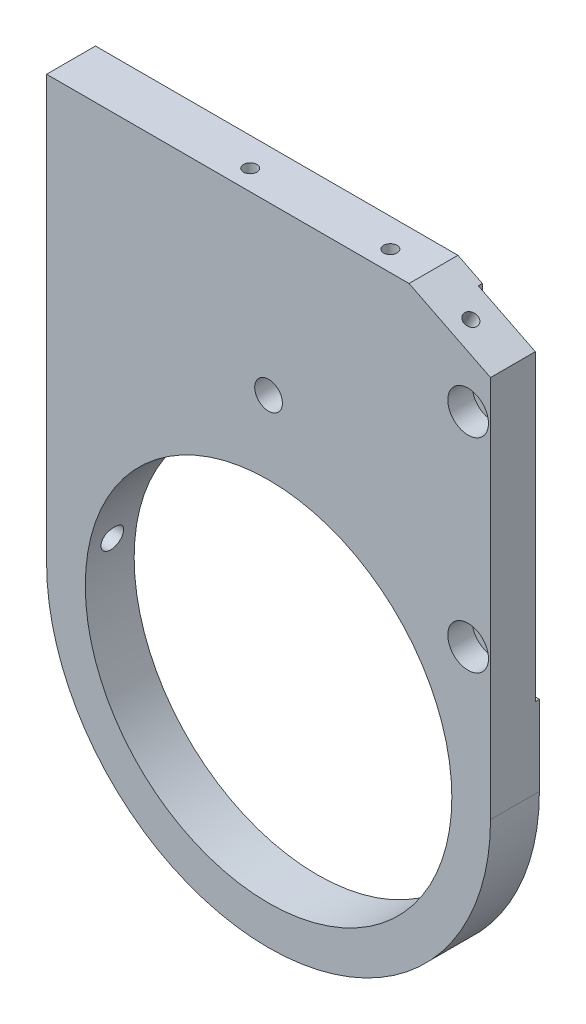
ISO-10303-21;
HEADER;
FILE_DESCRIPTION(('STEP AP214'),'2;1');
FILE_NAME('part.step','',(''),(''),'','','');
FILE_SCHEMA(('AUTOMOTIVE_DESIGN { 1 0 10303 214 1 1 1 1 }'));
ENDSEC;
DATA;
#1=APPLICATION_CONTEXT('core data for automotive mechanical design processes');
#2=APPLICATION_PROTOCOL_DEFINITION('international standard','automotive_design',2000,#1);
#3=PRODUCT_CONTEXT('',#1,'mechanical');
#4=PRODUCT('Part','Part','',(#3));
#5=PRODUCT_RELATED_PRODUCT_CATEGORY('part','',(#4));
#6=PRODUCT_DEFINITION_FORMATION('','',#4);
#7=PRODUCT_DEFINITION_CONTEXT('part definition',#1,'design');
#8=PRODUCT_DEFINITION('design','',#6,#7);
#9=PRODUCT_DEFINITION_SHAPE('','',#8);
#10=(LENGTH_UNIT() NAMED_UNIT(*) SI_UNIT(.MILLI.,.METRE.));
#11=(NAMED_UNIT(*) PLANE_ANGLE_UNIT() SI_UNIT($,.RADIAN.));
#12=(NAMED_UNIT(*) SI_UNIT($,.STERADIAN.) SOLID_ANGLE_UNIT());
#13=UNCERTAINTY_MEASURE_WITH_UNIT(LENGTH_MEASURE(1.E-05),#10,'distance_accuracy_value','');
#14=(GEOMETRIC_REPRESENTATION_CONTEXT(3) GLOBAL_UNCERTAINTY_ASSIGNED_CONTEXT((#13)) GLOBAL_UNIT_ASSIGNED_CONTEXT((#10,
#11,#12)) REPRESENTATION_CONTEXT('',''));
#15=CARTESIAN_POINT('',(0.,0.,0.));
#16=DIRECTION('',(0.,0.,1.));
#17=DIRECTION('',(1.,0.,0.));
#18=AXIS2_PLACEMENT_3D('',#15,#16,#17);
#19=CARTESIAN_POINT('',(49.,34.,20.7));
#20=DIRECTION('',(0.,0.,-1.));
#21=DIRECTION('',(1.,0.,0.));
#22=AXIS2_PLACEMENT_3D('',#19,#20,#21);
#23=CYLINDRICAL_SURFACE('',#22,3.25);
#24=CARTESIAN_POINT('',(49.,34.,-17.));
#25=DIRECTION('',(0.,0.,1.));
#26=DIRECTION('',(1.,0.,0.));
#27=AXIS2_PLACEMENT_3D('',#24,#25,#26);
#28=CIRCLE('',#27,3.25);
#29=CARTESIAN_POINT('',(52.25,34.,-17.));
#30=VERTEX_POINT('',#29);
#31=EDGE_CURVE('E181',#30,#30,#28,.T.);
#32=ORIENTED_EDGE('',*,*,#31,.F.);
#33=EDGE_LOOP('',(#32));
#34=FACE_BOUND('',#33,.T.);
#35=CARTESIAN_POINT('',(49.,34.,-12.));
#36=DIRECTION('',(0.,0.,-1.));
#37=DIRECTION('',(-1.,0.,0.));
#38=AXIS2_PLACEMENT_3D('',#35,#36,#37);
#39=CIRCLE('',#38,3.25);
#40=CARTESIAN_POINT('',(45.75,34.,-12.));
#41=VERTEX_POINT('',#40);
#42=EDGE_CURVE('E171',#41,#41,#39,.F.);
#43=ORIENTED_EDGE('',*,*,#42,.T.);
#44=EDGE_LOOP('',(#43));
#45=FACE_BOUND('',#44,.T.);
#46=ADVANCED_FACE('F36',(#34,#45),#23,.F.);
#47=CARTESIAN_POINT('',(49.,84.,20.7));
#48=DIRECTION('',(0.,0.,-1.));
#49=DIRECTION('',(1.,0.,0.));
#50=AXIS2_PLACEMENT_3D('',#47,#48,#49);
#51=CYLINDRICAL_SURFACE('',#50,3.25);
#52=CARTESIAN_POINT('',(49.,84.,-17.));
#53=DIRECTION('',(0.,0.,1.));
#54=DIRECTION('',(1.,0.,0.));
#55=AXIS2_PLACEMENT_3D('',#52,#53,#54);
#56=CIRCLE('',#55,3.25);
#57=CARTESIAN_POINT('',(52.25,84.,-17.));
#58=VERTEX_POINT('',#57);
#59=EDGE_CURVE('E184',#58,#58,#56,.T.);
#60=ORIENTED_EDGE('',*,*,#59,.F.);
#61=EDGE_LOOP('',(#60));
#62=FACE_BOUND('',#61,.T.);
#63=CARTESIAN_POINT('',(49.,84.,-12.));
#64=DIRECTION('',(0.,0.,-1.));
#65=DIRECTION('',(-1.,0.,0.));
#66=AXIS2_PLACEMENT_3D('',#63,#64,#65);
#67=CIRCLE('',#66,3.25);
#68=CARTESIAN_POINT('',(45.75,84.,-12.));
#69=VERTEX_POINT('',#68);
#70=EDGE_CURVE('E177',#69,#69,#67,.F.);
#71=ORIENTED_EDGE('',*,*,#70,.T.);
#72=EDGE_LOOP('',(#71));
#73=FACE_BOUND('',#72,.T.);
#74=ADVANCED_FACE('F301',(#62,#73),#51,.F.);
#75=CARTESIAN_POINT('',(0.,0.,-18.));
#76=DIRECTION('',(0.,0.,-1.));
#77=DIRECTION('',(1.,0.,0.));
#78=AXIS2_PLACEMENT_3D('',#75,#76,#77);
#79=PLANE('',#78);
#80=CARTESIAN_POINT('',(0.,63.,-18.));
#81=DIRECTION('',(0.,0.,1.));
#82=DIRECTION('',(1.,0.,0.));
#83=AXIS2_PLACEMENT_3D('',#80,#81,#82);
#84=CIRCLE('',#83,3.39999999999999);
#85=CARTESIAN_POINT('',(3.39999999999999,63.,-18.));
#86=VERTEX_POINT('',#85);
#87=EDGE_CURVE('E152',#86,#86,#84,.T.);
#88=ORIENTED_EDGE('',*,*,#87,.T.);
#89=EDGE_LOOP('',(#88));
#90=FACE_BOUND('',#89,.T.);
#91=DIRECTION('',(0.,-1.,0.));
#92=VECTOR('',#91,1.);
#93=CARTESIAN_POINT('',(40.5,104.,-18.));
#94=LINE('',#93,#92);
#95=CARTESIAN_POINT('',(40.5,101.,-18.));
#96=VERTEX_POINT('',#95);
#97=CARTESIAN_POINT('',(40.5,24.6,-18.));
#98=VERTEX_POINT('',#97);
#99=EDGE_CURVE('E187',#96,#98,#94,.T.);
#100=ORIENTED_EDGE('',*,*,#99,.T.);
#101=CARTESIAN_POINT('',(45.5,24.6,-18.));
#102=DIRECTION('',(0.,0.,1.));
#103=DIRECTION('',(1.,0.,0.));
#104=AXIS2_PLACEMENT_3D('',#101,#102,#103);
#105=CIRCLE('',#104,5.);
#106=CARTESIAN_POINT('',(45.5,19.6,-18.));
#107=VERTEX_POINT('',#106);
#108=EDGE_CURVE('E199',#98,#107,#105,.T.);
#109=ORIENTED_EDGE('',*,*,#108,.T.);
#110=DIRECTION('',(1.,0.,0.));
#111=VECTOR('',#110,1.);
#112=CARTESIAN_POINT('',(45.5,19.6,-18.));
#113=LINE('',#112,#111);
#114=CARTESIAN_POINT('',(54.5,19.6,-18.));
#115=VERTEX_POINT('',#114);
#116=EDGE_CURVE('E192',#107,#115,#113,.T.);
#117=ORIENTED_EDGE('',*,*,#116,.T.);
#118=DIRECTION('',(0.,1.,0.));
#119=VECTOR('',#118,1.);
#120=CARTESIAN_POINT('',(54.5,94.,-18.));
#121=LINE('',#120,#119);
#122=CARTESIAN_POINT('',(54.5,0.,-18.));
#123=VERTEX_POINT('',#122);
#124=EDGE_CURVE('E238',#123,#115,#121,.T.);
#125=ORIENTED_EDGE('',*,*,#124,.F.);
#126=CARTESIAN_POINT('',(0.,0.,-18.));
#127=DIRECTION('',(0.,0.,1.));
#128=DIRECTION('',(1.,0.,0.));
#129=AXIS2_PLACEMENT_3D('',#126,#127,#128);
#130=CIRCLE('',#129,54.5);
#131=CARTESIAN_POINT('',(-54.5,0.,-18.));
#132=VERTEX_POINT('',#131);
#133=EDGE_CURVE('E235',#132,#123,#130,.T.);
#134=ORIENTED_EDGE('',*,*,#133,.F.);
#135=DIRECTION('',(0.,-1.,0.));
#136=VECTOR('',#135,1.);
#137=CARTESIAN_POINT('',(-54.5,0.,-18.));
#138=LINE('',#137,#136);
#139=CARTESIAN_POINT('',(-54.5,104.,-18.));
#140=VERTEX_POINT('',#139);
#141=EDGE_CURVE('E248',#140,#132,#138,.T.);
#142=ORIENTED_EDGE('',*,*,#141,.F.);
#143=DIRECTION('',(-1.,0.,0.));
#144=VECTOR('',#143,1.);
#145=CARTESIAN_POINT('',(-54.5,104.,-18.));
#146=LINE('',#145,#144);
#147=CARTESIAN_POINT('',(34.5,104.,-18.));
#148=VERTEX_POINT('',#147);
#149=EDGE_CURVE('E245',#148,#140,#146,.T.);
#150=ORIENTED_EDGE('',*,*,#149,.F.);
#151=DIRECTION('',(-0.894427190999916,0.447213595499958,0.));
#152=VECTOR('',#151,1.);
#153=CARTESIAN_POINT('',(34.5,104.,-18.));
#154=LINE('',#153,#152);
#155=EDGE_CURVE('E242',#96,#148,#154,.T.);
#156=ORIENTED_EDGE('',*,*,#155,.F.);
#157=EDGE_LOOP('',(#100,#109,#117,#125,#134,#142,#150,#156));
#158=FACE_BOUND('',#157,.T.);
#159=CARTESIAN_POINT('',(0.,0.,-18.));
#160=DIRECTION('',(0.,0.,1.));
#161=DIRECTION('',(1.,0.,0.));
#162=AXIS2_PLACEMENT_3D('',#159,#160,#161);
#163=CIRCLE('',#162,45.);
#164=CARTESIAN_POINT('',(45.,0.,-18.));
#165=VERTEX_POINT('',#164);
#166=EDGE_CURVE('E229',#165,#165,#163,.T.);
#167=ORIENTED_EDGE('',*,*,#166,.T.);
#168=EDGE_LOOP('',(#167));
#169=FACE_BOUND('',#168,.T.);
#170=ADVANCED_FACE('F296',(#90,#158,#169),#79,.T.);
#171=CARTESIAN_POINT('',(0.,0.,-6.));
#172=DIRECTION('',(0.,0.,-1.));
#173=DIRECTION('',(1.,0.,0.));
#174=AXIS2_PLACEMENT_3D('',#171,#172,#173);
#175=PLANE('',#174);
#176=CARTESIAN_POINT('',(0.,63.,-6.));
#177=DIRECTION('',(0.,0.,1.));
#178=DIRECTION('',(1.,0.,0.));
#179=AXIS2_PLACEMENT_3D('',#176,#177,#178);
#180=CIRCLE('',#179,3.4);
#181=CARTESIAN_POINT('',(3.4,63.,-6.));
#182=VERTEX_POINT('',#181);
#183=EDGE_CURVE('E149',#182,#182,#180,.T.);
#184=ORIENTED_EDGE('',*,*,#183,.F.);
#185=EDGE_LOOP('',(#184));
#186=FACE_BOUND('',#185,.T.);
#187=CARTESIAN_POINT('',(49.,34.,-6.));
#188=DIRECTION('',(0.,0.,-1.));
#189=DIRECTION('',(-1.,0.,0.));
#190=AXIS2_PLACEMENT_3D('',#187,#188,#189);
#191=CIRCLE('',#190,5.);
#192=CARTESIAN_POINT('',(44.,34.,-6.));
#193=VERTEX_POINT('',#192);
#194=EDGE_CURVE('E167',#193,#193,#191,.T.);
#195=ORIENTED_EDGE('',*,*,#194,.T.);
#196=EDGE_LOOP('',(#195));
#197=FACE_BOUND('',#196,.T.);
#198=CARTESIAN_POINT('',(49.,84.,-6.));
#199=DIRECTION('',(0.,0.,-1.));
#200=DIRECTION('',(-1.,0.,0.));
#201=AXIS2_PLACEMENT_3D('',#198,#199,#200);
#202=CIRCLE('',#201,5.);
#203=CARTESIAN_POINT('',(44.,84.,-6.));
#204=VERTEX_POINT('',#203);
#205=EDGE_CURVE('E178',#204,#204,#202,.T.);
#206=ORIENTED_EDGE('',*,*,#205,.T.);
#207=EDGE_LOOP('',(#206));
#208=FACE_BOUND('',#207,.T.);
#209=CARTESIAN_POINT('',(0.,0.,-6.));
#210=DIRECTION('',(0.,0.,1.));
#211=DIRECTION('',(1.,0.,0.));
#212=AXIS2_PLACEMENT_3D('',#209,#210,#211);
#213=CIRCLE('',#212,54.5);
#214=CARTESIAN_POINT('',(-54.5,0.,-6.));
#215=VERTEX_POINT('',#214);
#216=CARTESIAN_POINT('',(54.5,0.,-6.));
#217=VERTEX_POINT('',#216);
#218=EDGE_CURVE('E232',#215,#217,#213,.T.);
#219=ORIENTED_EDGE('',*,*,#218,.T.);
#220=DIRECTION('',(0.,1.,0.));
#221=VECTOR('',#220,1.);
#222=CARTESIAN_POINT('',(54.5,94.,-6.));
#223=LINE('',#222,#221);
#224=CARTESIAN_POINT('',(54.5,94.,-6.));
#225=VERTEX_POINT('',#224);
#226=EDGE_CURVE('E254',#217,#225,#223,.T.);
#227=ORIENTED_EDGE('',*,*,#226,.T.);
#228=DIRECTION('',(-0.894427190999916,0.447213595499958,0.));
#229=VECTOR('',#228,1.);
#230=CARTESIAN_POINT('',(34.5,104.,-6.));
#231=LINE('',#230,#229);
#232=CARTESIAN_POINT('',(34.5,104.,-6.));
#233=VERTEX_POINT('',#232);
#234=EDGE_CURVE('E257',#225,#233,#231,.T.);
#235=ORIENTED_EDGE('',*,*,#234,.T.);
#236=DIRECTION('',(-1.,0.,0.));
#237=VECTOR('',#236,1.);
#238=CARTESIAN_POINT('',(-54.5,104.,-6.));
#239=LINE('',#238,#237);
#240=CARTESIAN_POINT('',(-54.5,104.,-6.));
#241=VERTEX_POINT('',#240);
#242=EDGE_CURVE('E260',#233,#241,#239,.T.);
#243=ORIENTED_EDGE('',*,*,#242,.T.);
#244=DIRECTION('',(0.,-1.,0.));
#245=VECTOR('',#244,1.);
#246=CARTESIAN_POINT('',(-54.5,0.,-6.));
#247=LINE('',#246,#245);
#248=EDGE_CURVE('E239',#241,#215,#247,.T.);
#249=ORIENTED_EDGE('',*,*,#248,.T.);
#250=EDGE_LOOP('',(#219,#227,#235,#243,#249));
#251=FACE_BOUND('',#250,.T.);
#252=CARTESIAN_POINT('',(0.,0.,-6.));
#253=DIRECTION('',(0.,0.,1.));
#254=DIRECTION('',(1.,0.,0.));
#255=AXIS2_PLACEMENT_3D('',#252,#253,#254);
#256=CIRCLE('',#255,45.);
#257=CARTESIAN_POINT('',(45.,0.,-6.));
#258=VERTEX_POINT('',#257);
#259=EDGE_CURVE('E228',#258,#258,#256,.T.);
#260=ORIENTED_EDGE('',*,*,#259,.F.);
#261=EDGE_LOOP('',(#260));
#262=FACE_BOUND('',#261,.T.);
#263=ADVANCED_FACE('F300',(#186,#197,#208,#251,#262),#175,.F.);
#264=CARTESIAN_POINT('',(0.,0.,-18.));
#265=DIRECTION('',(0.,0.,1.));
#266=DIRECTION('',(-1.,0.,0.));
#267=AXIS2_PLACEMENT_3D('',#264,#265,#266);
#268=CYLINDRICAL_SURFACE('',#267,54.5);
#269=ORIENTED_EDGE('',*,*,#218,.F.);
#270=DIRECTION('',(0.,0.,1.));
#271=VECTOR('',#270,1.);
#272=CARTESIAN_POINT('',(-54.5,0.,-18.));
#273=LINE('',#272,#271);
#274=EDGE_CURVE('E251',#132,#215,#273,.T.);
#275=ORIENTED_EDGE('',*,*,#274,.F.);
#276=ORIENTED_EDGE('',*,*,#133,.T.);
#277=DIRECTION('',(0.,0.,1.));
#278=VECTOR('',#277,1.);
#279=CARTESIAN_POINT('',(54.5,0.,-18.));
#280=LINE('',#279,#278);
#281=EDGE_CURVE('E272',#123,#217,#280,.T.);
#282=ORIENTED_EDGE('',*,*,#281,.T.);
#283=EDGE_LOOP('',(#269,#275,#276,#282));
#284=FACE_BOUND('',#283,.T.);
#285=ADVANCED_FACE('F38',(#284),#268,.T.);
#286=CARTESIAN_POINT('',(54.5,94.,-18.));
#287=DIRECTION('',(-1.,0.,0.));
#288=DIRECTION('',(0.,-1.,0.));
#289=AXIS2_PLACEMENT_3D('',#286,#287,#288);
#290=PLANE('',#289);
#291=DIRECTION('',(0.,1.,0.));
#292=VECTOR('',#291,1.);
#293=CARTESIAN_POINT('',(54.5,94.,-17.));
#294=LINE('',#293,#292);
#295=CARTESIAN_POINT('',(54.5,19.6,-17.));
#296=VERTEX_POINT('',#295);
#297=CARTESIAN_POINT('',(54.5,94.,-17.));
#298=VERTEX_POINT('',#297);
#299=EDGE_CURVE('E206',#296,#298,#294,.T.);
#300=ORIENTED_EDGE('',*,*,#299,.T.);
#301=DIRECTION('',(0.,0.,1.));
#302=VECTOR('',#301,1.);
#303=CARTESIAN_POINT('',(54.5,94.,-18.));
#304=LINE('',#303,#302);
#305=EDGE_CURVE('E270',#298,#225,#304,.T.);
#306=ORIENTED_EDGE('',*,*,#305,.T.);
#307=ORIENTED_EDGE('',*,*,#226,.F.);
#308=ORIENTED_EDGE('',*,*,#281,.F.);
#309=ORIENTED_EDGE('',*,*,#124,.T.);
#310=DIRECTION('',(0.,0.,-1.));
#311=VECTOR('',#310,1.);
#312=CARTESIAN_POINT('',(54.5,19.6,-18.));
#313=LINE('',#312,#311);
#314=EDGE_CURVE('E141',#296,#115,#313,.T.);
#315=ORIENTED_EDGE('',*,*,#314,.F.);
#316=EDGE_LOOP('',(#300,#306,#307,#308,#309,#315));
#317=FACE_BOUND('',#316,.T.);
#318=ADVANCED_FACE('F314',(#317),#290,.F.);
#319=CARTESIAN_POINT('',(34.5,104.,-18.));
#320=DIRECTION('',(-0.447213595499958,-0.894427190999916,0.));
#321=DIRECTION('',(0.894427190999916,-0.447213595499958,0.));
#322=AXIS2_PLACEMENT_3D('',#319,#320,#321);
#323=PLANE('',#322);
#324=CARTESIAN_POINT('',(44.6613008990009,98.9193495504995,-11.));
#325=DIRECTION('',(-0.447213595499958,-0.894427190999916,0.));
#326=DIRECTION('',(-0.894427190999916,0.447213595499958,0.));
#327=AXIS2_PLACEMENT_3D('',#324,#325,#326);
#328=CIRCLE('',#327,1.64999999999999);
#329=CARTESIAN_POINT('',(43.1854960338511,99.6572519830745,-11.));
#330=VERTEX_POINT('',#329);
#331=EDGE_CURVE('E222',#330,#330,#328,.T.);
#332=ORIENTED_EDGE('',*,*,#331,.T.);
#333=EDGE_LOOP('',(#332));
#334=FACE_BOUND('',#333,.T.);
#335=ORIENTED_EDGE('',*,*,#155,.T.);
#336=DIRECTION('',(0.,0.,1.));
#337=VECTOR('',#336,1.);
#338=CARTESIAN_POINT('',(34.5,104.,-18.));
#339=LINE('',#338,#337);
#340=EDGE_CURVE('E268',#148,#233,#339,.T.);
#341=ORIENTED_EDGE('',*,*,#340,.T.);
#342=ORIENTED_EDGE('',*,*,#234,.F.);
#343=ORIENTED_EDGE('',*,*,#305,.F.);
#344=DIRECTION('',(-0.894427190999916,0.447213595499958,0.));
#345=VECTOR('',#344,1.);
#346=CARTESIAN_POINT('',(34.5,104.,-17.));
#347=LINE('',#346,#345);
#348=CARTESIAN_POINT('',(40.5,101.,-17.));
#349=VERTEX_POINT('',#348);
#350=EDGE_CURVE('E64',#298,#349,#347,.T.);
#351=ORIENTED_EDGE('',*,*,#350,.T.);
#352=DIRECTION('',(0.,0.,1.));
#353=VECTOR('',#352,1.);
#354=CARTESIAN_POINT('',(40.5,101.,-18.));
#355=LINE('',#354,#353);
#356=EDGE_CURVE('E275',#96,#349,#355,.T.);
#357=ORIENTED_EDGE('',*,*,#356,.F.);
#358=EDGE_LOOP('',(#335,#341,#342,#343,#351,#357));
#359=FACE_BOUND('',#358,.T.);
#360=ADVANCED_FACE('F311',(#334,#359),#323,.F.);
#361=CARTESIAN_POINT('',(-54.5,104.,-18.));
#362=DIRECTION('',(0.,-1.,0.));
#363=DIRECTION('',(0.,0.,1.));
#364=AXIS2_PLACEMENT_3D('',#361,#362,#363);
#365=PLANE('',#364);
#366=CARTESIAN_POINT('',(-9.5,104.,-11.));
#367=DIRECTION('',(0.,-1.,0.));
#368=DIRECTION('',(0.,0.,-1.));
#369=AXIS2_PLACEMENT_3D('',#366,#367,#368);
#370=CIRCLE('',#369,1.64999999999999);
#371=CARTESIAN_POINT('',(-9.5,104.,-12.65));
#372=VERTEX_POINT('',#371);
#373=EDGE_CURVE('E210',#372,#372,#370,.T.);
#374=ORIENTED_EDGE('',*,*,#373,.T.);
#375=EDGE_LOOP('',(#374));
#376=FACE_BOUND('',#375,.T.);
#377=CARTESIAN_POINT('',(24.9,104.,-11.));
#378=DIRECTION('',(0.,-1.,0.));
#379=DIRECTION('',(0.,0.,-1.));
#380=AXIS2_PLACEMENT_3D('',#377,#378,#379);
#381=CIRCLE('',#380,1.64999999999999);
#382=CARTESIAN_POINT('',(24.9,104.,-12.65));
#383=VERTEX_POINT('',#382);
#384=EDGE_CURVE('E216',#383,#383,#381,.T.);
#385=ORIENTED_EDGE('',*,*,#384,.T.);
#386=EDGE_LOOP('',(#385));
#387=FACE_BOUND('',#386,.T.);
#388=ORIENTED_EDGE('',*,*,#242,.F.);
#389=ORIENTED_EDGE('',*,*,#340,.F.);
#390=ORIENTED_EDGE('',*,*,#149,.T.);
#391=DIRECTION('',(0.,0.,1.));
#392=VECTOR('',#391,1.);
#393=CARTESIAN_POINT('',(-54.5,104.,-18.));
#394=LINE('',#393,#392);
#395=EDGE_CURVE('E266',#140,#241,#394,.T.);
#396=ORIENTED_EDGE('',*,*,#395,.T.);
#397=EDGE_LOOP('',(#388,#389,#390,#396));
#398=FACE_BOUND('',#397,.T.);
#399=ADVANCED_FACE('F308',(#376,#387,#398),#365,.F.);
#400=CARTESIAN_POINT('',(-54.5,0.,-18.));
#401=DIRECTION('',(1.,0.,0.));
#402=DIRECTION('',(0.,0.,1.));
#403=AXIS2_PLACEMENT_3D('',#400,#401,#402);
#404=PLANE('',#403);
#405=CARTESIAN_POINT('',(-54.5,7.49999999999999,-12.));
#406=DIRECTION('',(1.,0.,0.));
#407=DIRECTION('',(0.,0.,-1.));
#408=AXIS2_PLACEMENT_3D('',#405,#406,#407);
#409=CIRCLE('',#408,2.74999999999999);
#410=CARTESIAN_POINT('',(-54.5,7.49999999999999,-14.75));
#411=VERTEX_POINT('',#410);
#412=EDGE_CURVE('E136',#411,#411,#409,.T.);
#413=ORIENTED_EDGE('',*,*,#412,.T.);
#414=EDGE_LOOP('',(#413));
#415=FACE_BOUND('',#414,.T.);
#416=CARTESIAN_POINT('',(-54.5,96.5,-12.));
#417=DIRECTION('',(1.,0.,0.));
#418=DIRECTION('',(0.,0.,-1.));
#419=AXIS2_PLACEMENT_3D('',#416,#417,#418);
#420=CIRCLE('',#419,2.75);
#421=CARTESIAN_POINT('',(-54.5,96.5,-14.75));
#422=VERTEX_POINT('',#421);
#423=EDGE_CURVE('E135',#422,#422,#420,.T.);
#424=ORIENTED_EDGE('',*,*,#423,.T.);
#425=EDGE_LOOP('',(#424));
#426=FACE_BOUND('',#425,.T.);
#427=CARTESIAN_POINT('',(-54.5,51.7,-12.));
#428=DIRECTION('',(1.,0.,0.));
#429=DIRECTION('',(0.,0.,-1.));
#430=AXIS2_PLACEMENT_3D('',#427,#428,#429);
#431=CIRCLE('',#430,2.75);
#432=CARTESIAN_POINT('',(-54.5,51.7,-14.75));
#433=VERTEX_POINT('',#432);
#434=EDGE_CURVE('E161',#433,#433,#431,.T.);
#435=ORIENTED_EDGE('',*,*,#434,.T.);
#436=EDGE_LOOP('',(#435));
#437=FACE_BOUND('',#436,.T.);
#438=ORIENTED_EDGE('',*,*,#248,.F.);
#439=ORIENTED_EDGE('',*,*,#395,.F.);
#440=ORIENTED_EDGE('',*,*,#141,.T.);
#441=ORIENTED_EDGE('',*,*,#274,.T.);
#442=EDGE_LOOP('',(#438,#439,#440,#441));
#443=FACE_BOUND('',#442,.T.);
#444=ADVANCED_FACE('F294',(#415,#426,#437,#443),#404,.F.);
#445=CARTESIAN_POINT('',(0.,0.,-18.));
#446=DIRECTION('',(0.,0.,1.));
#447=DIRECTION('',(-1.,0.,0.));
#448=AXIS2_PLACEMENT_3D('',#445,#446,#447);
#449=CYLINDRICAL_SURFACE('',#448,45.);
#450=CARTESIAN_POINT('',(-44.,9.43398113205663,-13.9550490993448));
#451=CARTESIAN_POINT('',(-44.011976021534,9.37812817582707,-14.0103095307376));
#452=CARTESIAN_POINT('',(-44.0243392489959,9.31994446006085,-14.0631205734754));
#453=CARTESIAN_POINT('',(-44.0496926743651,9.19936710301397,-14.1635147460379));
#454=CARTESIAN_POINT('',(-44.0626828013166,9.13697393786538,-14.2110984655317));
#455=CARTESIAN_POINT('',(-44.0891346342798,9.00846854245603,-14.3006851737243));
#456=CARTESIAN_POINT('',(-44.1025959496674,8.9423593665238,-14.3426926529634));
#457=CARTESIAN_POINT('',(-44.1298510423062,8.80687435804059,-14.4208893950192));
#458=CARTESIAN_POINT('',(-44.1436448224585,8.73749849698125,-14.4570786070477));
#459=CARTESIAN_POINT('',(-44.1853182362214,8.52515995560349,-14.556545660559));
#460=CARTESIAN_POINT('',(-44.2135096202768,8.37789135292483,-14.6107889454537));
#461=CARTESIAN_POINT('',(-44.2695883751528,8.0763290525313,-14.6934775454239));
#462=CARTESIAN_POINT('',(-44.2974757752716,7.92203603938962,-14.7219253688019));
#463=CARTESIAN_POINT('',(-44.3521627701137,7.60991767058596,-14.7522892405348));
#464=CARTESIAN_POINT('',(-44.3789569013564,7.45207953799485,-14.7540852470761));
#465=CARTESIAN_POINT('',(-44.4305432707907,7.13807738970346,-14.7306233738791));
#466=CARTESIAN_POINT('',(-44.4553353411416,6.98191351531269,-14.7053632284426));
#467=CARTESIAN_POINT('',(-44.5021565750129,6.67695294676972,-14.6286186008799));
#468=CARTESIAN_POINT('',(-44.5242043603484,6.52811127444672,-14.5773243993734));
#469=CARTESIAN_POINT('',(-44.565353005728,6.24102214648032,-14.4499247796013));
#470=CARTESIAN_POINT('',(-44.5844542048507,6.10277347276964,-14.3738222193021));
#471=CARTESIAN_POINT('',(-44.6192839779886,5.84264807884854,-14.1999676958559));
#472=CARTESIAN_POINT('',(-44.6350510719407,5.72059122786549,-14.102492938226));
#473=CARTESIAN_POINT('',(-44.663442683045,5.49453307413643,-13.8880854598219));
#474=CARTESIAN_POINT('',(-44.6760673172066,5.39053109916194,-13.7711534638073));
#475=CARTESIAN_POINT('',(-44.6981031355216,5.20464026067518,-13.5223988633219));
#476=CARTESIAN_POINT('',(-44.7075445381488,5.12254508898798,-13.390733064435));
#477=CARTESIAN_POINT('',(-44.7234715794312,4.98158061329772,-13.1153425252334));
#478=CARTESIAN_POINT('',(-44.7299573216891,4.92271049521346,-12.9716182078065));
#479=CARTESIAN_POINT('',(-44.740043135687,4.83018743556319,-12.6769934803995));
#480=CARTESIAN_POINT('',(-44.7436579406977,4.79640580202051,-12.526133974647));
#481=CARTESIAN_POINT('',(-44.7481245057342,4.75455617031421,-12.2208496751604));
#482=CARTESIAN_POINT('',(-44.7489762980504,4.74648787164722,-12.0664249231135));
#483=CARTESIAN_POINT('',(-44.7479351438064,4.75629289915102,-11.7587013308557));
#484=CARTESIAN_POINT('',(-44.7460473310182,4.77411770405075,-11.6054009243801));
#485=CARTESIAN_POINT('',(-44.7394989263067,4.83509719956772,-11.3039863833062));
#486=CARTESIAN_POINT('',(-44.7348383537977,4.87825171282987,-11.1558722124024));
#487=CARTESIAN_POINT('',(-44.722663687512,4.9886286718399,-10.8690118378584));
#488=CARTESIAN_POINT('',(-44.7151493262502,5.05585337364805,-10.7302665137946));
#489=CARTESIAN_POINT('',(-44.6971712095349,5.21239557321871,-10.4660694601178));
#490=CARTESIAN_POINT('',(-44.6867074366263,5.30171320173026,-10.3406178091849));
#491=CARTESIAN_POINT('',(-44.6627312890588,5.5000366253367,-10.1062574262923));
#492=CARTESIAN_POINT('',(-44.6492124305316,5.60908419407499,-9.99738471493906));
#493=CARTESIAN_POINT('',(-44.6191318594803,5.84354466289036,-9.79950239416836));
#494=CARTESIAN_POINT('',(-44.6025701338542,5.96895763343341,-9.71049287028211));
#495=CARTESIAN_POINT('',(-44.5664045625187,6.2332533077424,-9.55427988046516));
#496=CARTESIAN_POINT('',(-44.5467843255625,6.37220697995784,-9.48720032041813));
#497=CARTESIAN_POINT('',(-44.5048168983019,6.65899862311615,-9.37725213103433));
#498=CARTESIAN_POINT('',(-44.4824694803054,6.80683733534615,-9.33438552491784));
#499=CARTESIAN_POINT('',(-44.4352255721939,7.10874776278966,-9.27357898764126));
#500=CARTESIAN_POINT('',(-44.4103056381772,7.26286731613983,-9.25589491742549));
#501=CARTESIAN_POINT('',(-44.3587140064557,7.57159092577081,-9.24659692645809));
#502=CARTESIAN_POINT('',(-44.3320422647357,7.72619499413229,-9.25498366099382));
#503=CARTESIAN_POINT('',(-44.2773879949955,8.03352812387547,-9.29773955726598));
#504=CARTESIAN_POINT('',(-44.2493933951712,8.18621086857198,-9.33242641648354));
#505=CARTESIAN_POINT('',(-44.1933639970025,8.48348213699479,-9.42714180100983));
#506=CARTESIAN_POINT('',(-44.1653292017919,8.62807125990156,-9.48716844756627));
#507=CARTESIAN_POINT('',(-44.1134985751028,8.88902977718555,-9.62258272680636));
#508=CARTESIAN_POINT('',(-44.0895889682021,9.00672539640449,-9.69537163950541));
#509=CARTESIAN_POINT('',(-44.0549439066811,9.1741584471633,-9.81723305723641));
#510=CARTESIAN_POINT('',(-44.0435962374711,9.22846283599596,-9.85997815128708));
#511=CARTESIAN_POINT('',(-44.0214000625597,9.33376835199734,-9.94949575255072));
#512=CARTESIAN_POINT('',(-44.010551640033,9.38476892932272,-9.99626892714303));
#513=CARTESIAN_POINT('',(-44.,9.43398113205663,-10.0449509006552));
#514=B_SPLINE_CURVE_WITH_KNOTS('',3,(#450,#451,#452,#453,#454,#455,#456,#457,#458,#459,#460,
#461,#462,#463,#464,#465,#466,#467,#468,#469,#470,#471,#472,#473,#474,#475,#476,#477,#478,#479,
#480,#481,#482,#483,#484,#485,#486,#487,#488,#489,#490,#491,#492,#493,#494,#495,#496,#497,#498,
#499,#500,#501,#502,#503,#504,#505,#506,#507,#508,#509,#510,#511,#512,#513),.UNSPECIFIED.,.F.,
.F.,(4,2,2,2,2,2,2,2,2,2,2,2,2,2,2,2,2,2,2,2,2,2,2,2,2,2,2,2,2,2,2,4),(0.,0.238349708406423,
0.476672502060293,0.714802195008163,0.952933966499027,1.42884994235872,1.90471963607224,
2.38273203590036,2.86078446789944,3.33539211915668,3.80994511409395,4.27867312646997,
4.74738368317759,5.21151049417553,5.67562103522228,6.1373341482643,6.59904186539582,
7.05988550046381,7.52072590880736,7.98160952229683,8.44249586342537,8.90436969512156,
9.36624551561461,9.83068759472788,10.2951684766112,10.7643357297467,11.233514775455,
11.7084534829172,12.183356983473,12.6030237736965,12.8129565208491,13.0229241171853),.UNSPECIFIED.);
#515=CARTESIAN_POINT('',(-44.,9.43398113205663,-13.9550490993448));
#516=VERTEX_POINT('',#515);
#517=CARTESIAN_POINT('',(-44.,9.43398113205663,-10.0449509006552));
#518=VERTEX_POINT('',#517);
#519=EDGE_CURVE('E11',#516,#518,#514,.T.);
#520=ORIENTED_EDGE('',*,*,#519,.T.);
#521=CARTESIAN_POINT('',(-44.1654366702326,8.62636677446982,-9.19216510842659));
#522=CARTESIAN_POINT('',(-44.1499597186301,8.70560844909689,-9.25171217574942));
#523=CARTESIAN_POINT('',(-44.1347571349064,8.7823064937893,-9.31463198489617));
#524=CARTESIAN_POINT('',(-44.1050752535846,8.93017441812751,-9.4468189903554));
#525=CARTESIAN_POINT('',(-44.0905959612993,9.00134425716954,-9.51608623328061));
#526=CARTESIAN_POINT('',(-44.0485179548386,9.20583635830879,-9.7327448317821));
#527=CARTESIAN_POINT('',(-44.0222647100553,9.33021411262185,-9.88904797070606));
#528=CARTESIAN_POINT('',(-43.9748864370287,9.55103028245376,-10.2207322111984));
#529=CARTESIAN_POINT('',(-43.9537580829596,9.64748682549906,-10.3961008325135));
#530=CARTESIAN_POINT('',(-43.9178904784435,9.80947540043492,-10.761122561403));
#531=CARTESIAN_POINT('',(-43.9031472776892,9.87502655481516,-10.9507667516006));
#532=CARTESIAN_POINT('',(-43.8812432614702,9.97190715337074,-11.3349306498835));
#533=CARTESIAN_POINT('',(-43.8739350940435,10.0039020486525,-11.5292741245753));
#534=CARTESIAN_POINT('',(-43.8668767998707,10.0348086964237,-11.9207342323572));
#535=CARTESIAN_POINT('',(-43.8671268606289,10.0337196281666,-12.1178509341242));
#536=CARTESIAN_POINT('',(-43.8750756839739,9.99890111406923,-12.5044926703262));
#537=CARTESIAN_POINT('',(-43.8826055752698,9.9659116625527,-12.6940885253569));
#538=CARTESIAN_POINT('',(-43.9043797004795,9.8695418542053,-13.0650005918672));
#539=CARTESIAN_POINT('',(-43.9186247915346,9.80615761770638,-13.2463157431398));
#540=CARTESIAN_POINT('',(-43.9530942774833,9.65048617929729,-13.5971786834387));
#541=CARTESIAN_POINT('',(-43.9733657165264,9.55797122155393,-13.7666204196684));
#542=CARTESIAN_POINT('',(-44.0186904156076,9.34700320053431,-14.0877174773402));
#543=CARTESIAN_POINT('',(-44.0437408089291,9.22856568099584,-14.2393833742406));
#544=CARTESIAN_POINT('',(-44.0854263554831,9.02666186087815,-14.458608381098));
#545=CARTESIAN_POINT('',(-44.1008756083629,8.95093506491039,-14.5336707709152));
#546=CARTESIAN_POINT('',(-44.1325919585728,8.79322457062699,-14.6763840555572));
#547=CARTESIAN_POINT('',(-44.1488574080042,8.71125331910819,-14.7440490716107));
#548=CARTESIAN_POINT('',(-44.1654366702326,8.62636677446981,-14.8078348915734));
#549=B_SPLINE_CURVE_WITH_KNOTS('',3,(#521,#522,#523,#524,#525,#526,#527,#528,#529,#530,#531,
#532,#533,#534,#535,#536,#537,#538,#539,#540,#541,#542,#543,#544,#545,#546,#547,#548),
.UNSPECIFIED.,.F.,.F.,(4,2,2,2,2,2,2,2,2,2,2,2,2,4),(0.,0.300780349215219,0.601562907404384,
1.20285432391675,1.80375447877213,2.40428234139359,2.99266204068942,3.58105633651336,
4.1561211426298,4.73125937103429,5.31101084635853,5.89041563771259,6.21323928782146,
6.53543550688594),.UNSPECIFIED.);
#550=EDGE_CURVE('E50',#518,#516,#549,.T.);
#551=ORIENTED_EDGE('',*,*,#550,.T.);
#552=EDGE_LOOP('',(#520,#551));
#553=FACE_BOUND('',#552,.T.);
#554=ORIENTED_EDGE('',*,*,#166,.F.);
#555=EDGE_LOOP('',(#554));
#556=FACE_BOUND('',#555,.T.);
#557=ORIENTED_EDGE('',*,*,#259,.T.);
#558=EDGE_LOOP('',(#557));
#559=FACE_BOUND('',#558,.T.);
#560=ADVANCED_FACE('F139',(#553,#556,#559),#449,.F.);
#561=CARTESIAN_POINT('',(35.7170289890018,81.0308057305012,-11.));
#562=DIRECTION('',(0.447213595499958,0.894427190999916,0.));
#563=DIRECTION('',(-0.894427190999916,0.447213595499958,0.));
#564=AXIS2_PLACEMENT_3D('',#561,#562,#563);
#565=CONICAL_SURFACE('',#564,1.65,1.02974425867665);
#566=CARTESIAN_POINT('',(35.2736524765828,80.1440527056634,-11.));
#567=VERTEX_POINT('',#566);
#568=VERTEX_LOOP('',#567);
#569=FACE_BOUND('',#568,.T.);
#570=CARTESIAN_POINT('',(35.7170289890018,81.0308057305012,-11.));
#571=DIRECTION('',(-0.447213595499958,-0.894427190999916,0.));
#572=DIRECTION('',(-0.894427190999916,0.447213595499958,0.));
#573=AXIS2_PLACEMENT_3D('',#570,#571,#572);
#574=CIRCLE('',#573,1.65);
#575=CARTESIAN_POINT('',(34.2412241238519,81.7687081630762,-11.));
#576=VERTEX_POINT('',#575);
#577=EDGE_CURVE('E225',#576,#576,#574,.T.);
#578=ORIENTED_EDGE('',*,*,#577,.F.);
#579=EDGE_LOOP('',(#578));
#580=FACE_BOUND('',#579,.T.);
#581=ADVANCED_FACE('F293',(#569,#580),#565,.F.);
#582=CARTESIAN_POINT('',(44.6613008990009,98.9193495504995,-11.));
#583=DIRECTION('',(0.447213595499958,0.894427190999916,0.));
#584=DIRECTION('',(-0.894427190999916,0.447213595499958,0.));
#585=AXIS2_PLACEMENT_3D('',#582,#583,#584);
#586=CYLINDRICAL_SURFACE('',#585,1.64999999999999);
#587=ORIENTED_EDGE('',*,*,#577,.T.);
#588=EDGE_LOOP('',(#587));
#589=FACE_BOUND('',#588,.T.);
#590=ORIENTED_EDGE('',*,*,#331,.F.);
#591=EDGE_LOOP('',(#590));
#592=FACE_BOUND('',#591,.T.);
#593=ADVANCED_FACE('F367',(#589,#592),#586,.F.);
#594=CARTESIAN_POINT('',(24.9,84.,-11.));
#595=DIRECTION('',(0.,1.,0.));
#596=DIRECTION('',(0.,0.,-1.));
#597=AXIS2_PLACEMENT_3D('',#594,#595,#596);
#598=CONICAL_SURFACE('',#597,1.64999999999998,1.02974425867665);
#599=CARTESIAN_POINT('',(24.9,83.0085799786045,-11.));
#600=VERTEX_POINT('',#599);
#601=VERTEX_LOOP('',#600);
#602=FACE_BOUND('',#601,.T.);
#603=CARTESIAN_POINT('',(24.9,84.,-11.));
#604=DIRECTION('',(0.,-1.,0.));
#605=DIRECTION('',(0.,0.,-1.));
#606=AXIS2_PLACEMENT_3D('',#603,#604,#605);
#607=CIRCLE('',#606,1.64999999999998);
#608=CARTESIAN_POINT('',(24.9,84.,-12.65));
#609=VERTEX_POINT('',#608);
#610=EDGE_CURVE('E219',#609,#609,#607,.T.);
#611=ORIENTED_EDGE('',*,*,#610,.F.);
#612=EDGE_LOOP('',(#611));
#613=FACE_BOUND('',#612,.T.);
#614=ADVANCED_FACE('F364',(#602,#613),#598,.F.);
#615=CARTESIAN_POINT('',(24.9,104.,-11.));
#616=DIRECTION('',(0.,1.,0.));
#617=DIRECTION('',(0.,0.,-1.));
#618=AXIS2_PLACEMENT_3D('',#615,#616,#617);
#619=CYLINDRICAL_SURFACE('',#618,1.64999999999999);
#620=ORIENTED_EDGE('',*,*,#610,.T.);
#621=EDGE_LOOP('',(#620));
#622=FACE_BOUND('',#621,.T.);
#623=ORIENTED_EDGE('',*,*,#384,.F.);
#624=EDGE_LOOP('',(#623));
#625=FACE_BOUND('',#624,.T.);
#626=ADVANCED_FACE('F360',(#622,#625),#619,.F.);
#627=CARTESIAN_POINT('',(-9.5,84.,-11.));
#628=DIRECTION('',(0.,1.,0.));
#629=DIRECTION('',(0.,0.,-1.));
#630=AXIS2_PLACEMENT_3D('',#627,#628,#629);
#631=CONICAL_SURFACE('',#630,1.64999999999999,1.02974425867665);
#632=CARTESIAN_POINT('',(-9.50000000000001,83.0085799786045,-11.));
#633=VERTEX_POINT('',#632);
#634=VERTEX_LOOP('',#633);
#635=FACE_BOUND('',#634,.T.);
#636=CARTESIAN_POINT('',(-9.5,84.,-11.));
#637=DIRECTION('',(0.,-1.,0.));
#638=DIRECTION('',(0.,0.,-1.));
#639=AXIS2_PLACEMENT_3D('',#636,#637,#638);
#640=CIRCLE('',#639,1.64999999999999);
#641=CARTESIAN_POINT('',(-9.5,84.,-12.65));
#642=VERTEX_POINT('',#641);
#643=EDGE_CURVE('E213',#642,#642,#640,.T.);
#644=ORIENTED_EDGE('',*,*,#643,.F.);
#645=EDGE_LOOP('',(#644));
#646=FACE_BOUND('',#645,.T.);
#647=ADVANCED_FACE('F356',(#635,#646),#631,.F.);
#648=CARTESIAN_POINT('',(-9.5,104.,-11.));
#649=DIRECTION('',(0.,1.,0.));
#650=DIRECTION('',(0.,0.,-1.));
#651=AXIS2_PLACEMENT_3D('',#648,#649,#650);
#652=CYLINDRICAL_SURFACE('',#651,1.64999999999999);
#653=ORIENTED_EDGE('',*,*,#643,.T.);
#654=EDGE_LOOP('',(#653));
#655=FACE_BOUND('',#654,.T.);
#656=ORIENTED_EDGE('',*,*,#373,.F.);
#657=EDGE_LOOP('',(#656));
#658=FACE_BOUND('',#657,.T.);
#659=ADVANCED_FACE('F345',(#655,#658),#652,.F.);
#660=CARTESIAN_POINT('',(45.5,19.6,-17.));
#661=DIRECTION('',(0.,-1.,0.));
#662=DIRECTION('',(0.,0.,1.));
#663=AXIS2_PLACEMENT_3D('',#660,#661,#662);
#664=PLANE('',#663);
#665=DIRECTION('',(1.,0.,0.));
#666=VECTOR('',#665,1.);
#667=CARTESIAN_POINT('',(45.5,19.6,-17.));
#668=LINE('',#667,#666);
#669=CARTESIAN_POINT('',(45.5,19.6,-17.));
#670=VERTEX_POINT('',#669);
#671=EDGE_CURVE('E194',#670,#296,#668,.T.);
#672=ORIENTED_EDGE('',*,*,#671,.T.);
#673=ORIENTED_EDGE('',*,*,#314,.T.);
#674=ORIENTED_EDGE('',*,*,#116,.F.);
#675=DIRECTION('',(0.,0.,-1.));
#676=VECTOR('',#675,1.);
#677=CARTESIAN_POINT('',(45.5,19.6,-17.));
#678=LINE('',#677,#676);
#679=EDGE_CURVE('E204',#670,#107,#678,.T.);
#680=ORIENTED_EDGE('',*,*,#679,.F.);
#681=EDGE_LOOP('',(#672,#673,#674,#680));
#682=FACE_BOUND('',#681,.T.);
#683=ADVANCED_FACE('F342',(#682),#664,.F.);
#684=CARTESIAN_POINT('',(40.5,104.,-17.));
#685=DIRECTION('',(-1.,0.,0.));
#686=DIRECTION('',(0.,-1.,0.));
#687=AXIS2_PLACEMENT_3D('',#684,#685,#686);
#688=PLANE('',#687);
#689=ORIENTED_EDGE('',*,*,#99,.F.);
#690=ORIENTED_EDGE('',*,*,#356,.T.);
#691=DIRECTION('',(0.,-1.,0.));
#692=VECTOR('',#691,1.);
#693=CARTESIAN_POINT('',(40.5,104.,-17.));
#694=LINE('',#693,#692);
#695=CARTESIAN_POINT('',(40.5,24.6,-17.));
#696=VERTEX_POINT('',#695);
#697=EDGE_CURVE('E188',#349,#696,#694,.T.);
#698=ORIENTED_EDGE('',*,*,#697,.T.);
#699=DIRECTION('',(0.,0.,-1.));
#700=VECTOR('',#699,1.);
#701=CARTESIAN_POINT('',(40.5,24.6,-17.));
#702=LINE('',#701,#700);
#703=EDGE_CURVE('E196',#696,#98,#702,.T.);
#704=ORIENTED_EDGE('',*,*,#703,.T.);
#705=EDGE_LOOP('',(#689,#690,#698,#704));
#706=FACE_BOUND('',#705,.T.);
#707=ADVANCED_FACE('F340',(#706),#688,.F.);
#708=CARTESIAN_POINT('',(45.5,24.6,-17.));
#709=DIRECTION('',(0.,0.,-1.));
#710=DIRECTION('',(1.,0.,0.));
#711=AXIS2_PLACEMENT_3D('',#708,#709,#710);
#712=PLANE('',#711);
#713=ORIENTED_EDGE('',*,*,#31,.T.);
#714=EDGE_LOOP('',(#713));
#715=FACE_BOUND('',#714,.T.);
#716=ORIENTED_EDGE('',*,*,#59,.T.);
#717=EDGE_LOOP('',(#716));
#718=FACE_BOUND('',#717,.T.);
#719=ORIENTED_EDGE('',*,*,#299,.F.);
#720=ORIENTED_EDGE('',*,*,#671,.F.);
#721=CARTESIAN_POINT('',(45.5,24.6,-17.));
#722=DIRECTION('',(0.,0.,1.));
#723=DIRECTION('',(1.,0.,0.));
#724=AXIS2_PLACEMENT_3D('',#721,#722,#723);
#725=CIRCLE('',#724,5.);
#726=EDGE_CURVE('E191',#696,#670,#725,.T.);
#727=ORIENTED_EDGE('',*,*,#726,.F.);
#728=ORIENTED_EDGE('',*,*,#697,.F.);
#729=ORIENTED_EDGE('',*,*,#350,.F.);
#730=EDGE_LOOP('',(#719,#720,#727,#728,#729));
#731=FACE_BOUND('',#730,.T.);
#732=ADVANCED_FACE('F336',(#715,#718,#731),#712,.T.);
#733=CARTESIAN_POINT('',(45.5,24.6,-17.));
#734=DIRECTION('',(0.,0.,-1.));
#735=DIRECTION('',(1.,0.,0.));
#736=AXIS2_PLACEMENT_3D('',#733,#734,#735);
#737=CYLINDRICAL_SURFACE('',#736,5.);
#738=ORIENTED_EDGE('',*,*,#108,.F.);
#739=ORIENTED_EDGE('',*,*,#703,.F.);
#740=ORIENTED_EDGE('',*,*,#726,.T.);
#741=ORIENTED_EDGE('',*,*,#679,.T.);
#742=EDGE_LOOP('',(#738,#739,#740,#741));
#743=FACE_BOUND('',#742,.T.);
#744=ADVANCED_FACE('F339',(#743),#737,.F.);
#745=CARTESIAN_POINT('',(49.,84.,-12.));
#746=DIRECTION('',(0.,0.,1.));
#747=DIRECTION('',(-1.,0.,0.));
#748=AXIS2_PLACEMENT_3D('',#745,#746,#747);
#749=PLANE('',#748);
#750=CARTESIAN_POINT('',(49.,84.,-12.));
#751=DIRECTION('',(0.,0.,-1.));
#752=DIRECTION('',(-1.,0.,0.));
#753=AXIS2_PLACEMENT_3D('',#750,#751,#752);
#754=CIRCLE('',#753,5.);
#755=CARTESIAN_POINT('',(44.,84.,-12.));
#756=VERTEX_POINT('',#755);
#757=EDGE_CURVE('E174',#756,#756,#754,.T.);
#758=ORIENTED_EDGE('',*,*,#757,.F.);
#759=EDGE_LOOP('',(#758));
#760=FACE_BOUND('',#759,.T.);
#761=ORIENTED_EDGE('',*,*,#70,.F.);
#762=EDGE_LOOP('',(#761));
#763=FACE_BOUND('',#762,.T.);
#764=ADVANCED_FACE('F349',(#760,#763),#749,.T.);
#765=CARTESIAN_POINT('',(49.,84.,-12.));
#766=DIRECTION('',(0.,0.,1.));
#767=DIRECTION('',(-1.,0.,0.));
#768=AXIS2_PLACEMENT_3D('',#765,#766,#767);
#769=CYLINDRICAL_SURFACE('',#768,5.);
#770=ORIENTED_EDGE('',*,*,#757,.T.);
#771=EDGE_LOOP('',(#770));
#772=FACE_BOUND('',#771,.T.);
#773=ORIENTED_EDGE('',*,*,#205,.F.);
#774=EDGE_LOOP('',(#773));
#775=FACE_BOUND('',#774,.T.);
#776=ADVANCED_FACE('F333',(#772,#775),#769,.F.);
#777=CARTESIAN_POINT('',(49.,34.,-12.));
#778=DIRECTION('',(0.,0.,1.));
#779=DIRECTION('',(-1.,0.,0.));
#780=AXIS2_PLACEMENT_3D('',#777,#778,#779);
#781=PLANE('',#780);
#782=CARTESIAN_POINT('',(49.,34.,-12.));
#783=DIRECTION('',(0.,0.,-1.));
#784=DIRECTION('',(-1.,0.,0.));
#785=AXIS2_PLACEMENT_3D('',#782,#783,#784);
#786=CIRCLE('',#785,5.);
#787=CARTESIAN_POINT('',(44.,34.,-12.));
#788=VERTEX_POINT('',#787);
#789=EDGE_CURVE('E168',#788,#788,#786,.T.);
#790=ORIENTED_EDGE('',*,*,#789,.F.);
#791=EDGE_LOOP('',(#790));
#792=FACE_BOUND('',#791,.T.);
#793=ORIENTED_EDGE('',*,*,#42,.F.);
#794=EDGE_LOOP('',(#793));
#795=FACE_BOUND('',#794,.T.);
#796=ADVANCED_FACE('F573',(#792,#795),#781,.T.);
#797=CARTESIAN_POINT('',(49.,34.,-12.));
#798=DIRECTION('',(0.,0.,1.));
#799=DIRECTION('',(-1.,0.,0.));
#800=AXIS2_PLACEMENT_3D('',#797,#798,#799);
#801=CYLINDRICAL_SURFACE('',#800,5.);
#802=ORIENTED_EDGE('',*,*,#789,.T.);
#803=EDGE_LOOP('',(#802));
#804=FACE_BOUND('',#803,.T.);
#805=ORIENTED_EDGE('',*,*,#194,.F.);
#806=EDGE_LOOP('',(#805));
#807=FACE_BOUND('',#806,.T.);
#808=ADVANCED_FACE('F582',(#804,#807),#801,.F.);
#809=CARTESIAN_POINT('',(-32.,51.7,-12.));
#810=DIRECTION('',(-1.,0.,0.));
#811=DIRECTION('',(0.,0.,-1.));
#812=AXIS2_PLACEMENT_3D('',#809,#810,#811);
#813=CONICAL_SURFACE('',#812,2.75,1.02974425867665);
#814=CARTESIAN_POINT('',(-30.3476332976742,51.7,-12.));
#815=VERTEX_POINT('',#814);
#816=VERTEX_LOOP('',#815);
#817=FACE_BOUND('',#816,.T.);
#818=CARTESIAN_POINT('',(-32.,51.7,-12.));
#819=DIRECTION('',(1.,0.,0.));
#820=DIRECTION('',(0.,0.,-1.));
#821=AXIS2_PLACEMENT_3D('',#818,#819,#820);
#822=CIRCLE('',#821,2.75);
#823=CARTESIAN_POINT('',(-32.,51.7,-14.75));
#824=VERTEX_POINT('',#823);
#825=EDGE_CURVE('E164',#824,#824,#822,.T.);
#826=ORIENTED_EDGE('',*,*,#825,.F.);
#827=EDGE_LOOP('',(#826));
#828=FACE_BOUND('',#827,.T.);
#829=ADVANCED_FACE('F496',(#817,#828),#813,.F.);
#830=CARTESIAN_POINT('',(-54.5,51.7,-12.));
#831=DIRECTION('',(-1.,0.,0.));
#832=DIRECTION('',(0.,0.,-1.));
#833=AXIS2_PLACEMENT_3D('',#830,#831,#832);
#834=CYLINDRICAL_SURFACE('',#833,2.75);
#835=ORIENTED_EDGE('',*,*,#825,.T.);
#836=EDGE_LOOP('',(#835));
#837=FACE_BOUND('',#836,.T.);
#838=ORIENTED_EDGE('',*,*,#434,.F.);
#839=EDGE_LOOP('',(#838));
#840=FACE_BOUND('',#839,.T.);
#841=ADVANCED_FACE('F491',(#837,#840),#834,.F.);
#842=CARTESIAN_POINT('',(-32.,96.5,-12.));
#843=DIRECTION('',(-1.,0.,0.));
#844=DIRECTION('',(0.,0.,-1.));
#845=AXIS2_PLACEMENT_3D('',#842,#843,#844);
#846=CONICAL_SURFACE('',#845,2.75,1.02974425867665);
#847=CARTESIAN_POINT('',(-30.3476332976742,96.5,-12.));
#848=VERTEX_POINT('',#847);
#849=VERTEX_LOOP('',#848);
#850=FACE_BOUND('',#849,.T.);
#851=CARTESIAN_POINT('',(-32.,96.5,-12.));
#852=DIRECTION('',(1.,0.,0.));
#853=DIRECTION('',(0.,0.,-1.));
#854=AXIS2_PLACEMENT_3D('',#851,#852,#853);
#855=CIRCLE('',#854,2.75);
#856=CARTESIAN_POINT('',(-32.,96.5,-14.75));
#857=VERTEX_POINT('',#856);
#858=EDGE_CURVE('E158',#857,#857,#855,.T.);
#859=ORIENTED_EDGE('',*,*,#858,.F.);
#860=EDGE_LOOP('',(#859));
#861=FACE_BOUND('',#860,.T.);
#862=ADVANCED_FACE('F484',(#850,#861),#846,.F.);
#863=CARTESIAN_POINT('',(-54.5,96.5,-12.));
#864=DIRECTION('',(-1.,0.,0.));
#865=DIRECTION('',(0.,0.,-1.));
#866=AXIS2_PLACEMENT_3D('',#863,#864,#865);
#867=CYLINDRICAL_SURFACE('',#866,2.75);
#868=ORIENTED_EDGE('',*,*,#858,.T.);
#869=EDGE_LOOP('',(#868));
#870=FACE_BOUND('',#869,.T.);
#871=ORIENTED_EDGE('',*,*,#423,.F.);
#872=EDGE_LOOP('',(#871));
#873=FACE_BOUND('',#872,.T.);
#874=ADVANCED_FACE('F479',(#870,#873),#867,.F.);
#875=CARTESIAN_POINT('',(-44.,7.49999999999999,-12.));
#876=DIRECTION('',(-1.,0.,0.));
#877=DIRECTION('',(0.,0.,-1.));
#878=AXIS2_PLACEMENT_3D('',#875,#876,#877);
#879=CONICAL_SURFACE('',#878,2.75,1.02974425867665);
#880=ORIENTED_EDGE('',*,*,#550,.F.);
#881=CARTESIAN_POINT('',(-44.,7.49999999999999,-12.));
#882=DIRECTION('',(1.,0.,0.));
#883=DIRECTION('',(0.,0.,-1.));
#884=AXIS2_PLACEMENT_3D('',#881,#882,#883);
#885=CIRCLE('',#884,2.75);
#886=EDGE_CURVE('E56',#516,#518,#885,.T.);
#887=ORIENTED_EDGE('',*,*,#886,.F.);
#888=EDGE_LOOP('',(#880,#887));
#889=FACE_BOUND('',#888,.T.);
#890=ADVANCED_FACE('F134',(#889),#879,.F.);
#891=CARTESIAN_POINT('',(-54.5,7.49999999999999,-12.));
#892=DIRECTION('',(-1.,0.,0.));
#893=DIRECTION('',(0.,0.,-1.));
#894=AXIS2_PLACEMENT_3D('',#891,#892,#893);
#895=CYLINDRICAL_SURFACE('',#894,2.74999999999999);
#896=ORIENTED_EDGE('',*,*,#519,.F.);
#897=ORIENTED_EDGE('',*,*,#886,.T.);
#898=EDGE_LOOP('',(#896,#897));
#899=FACE_BOUND('',#898,.T.);
#900=ORIENTED_EDGE('',*,*,#412,.F.);
#901=EDGE_LOOP('',(#900));
#902=FACE_BOUND('',#901,.T.);
#903=ADVANCED_FACE('F142',(#899,#902),#895,.F.);
#904=CARTESIAN_POINT('',(0.,63.,-18.));
#905=DIRECTION('',(0.,0.,-1.));
#906=DIRECTION('',(1.,0.,0.));
#907=AXIS2_PLACEMENT_3D('',#904,#905,#906);
#908=CYLINDRICAL_SURFACE('',#907,3.39999999999999);
#909=ORIENTED_EDGE('',*,*,#183,.T.);
#910=EDGE_LOOP('',(#909));
#911=FACE_BOUND('',#910,.T.);
#912=ORIENTED_EDGE('',*,*,#87,.F.);
#913=EDGE_LOOP('',(#912));
#914=FACE_BOUND('',#913,.T.);
#915=ADVANCED_FACE('F145',(#911,#914),#908,.F.);
#916=CLOSED_SHELL('',(#46,#74,#170,#263,#285,#318,#360,#399,#444,#560,#581,#593,#614,#626,#647,
#659,#683,#707,#732,#744,#764,#776,#796,#808,#829,#841,#862,#874,#890,#903,#915));
#917=MANIFOLD_SOLID_BREP('B2',#916);
#918=ADVANCED_BREP_SHAPE_REPRESENTATION('',(#18,#917),#14);
#919=SHAPE_DEFINITION_REPRESENTATION(#9,#918);
ENDSEC;
END-ISO-10303-21;
